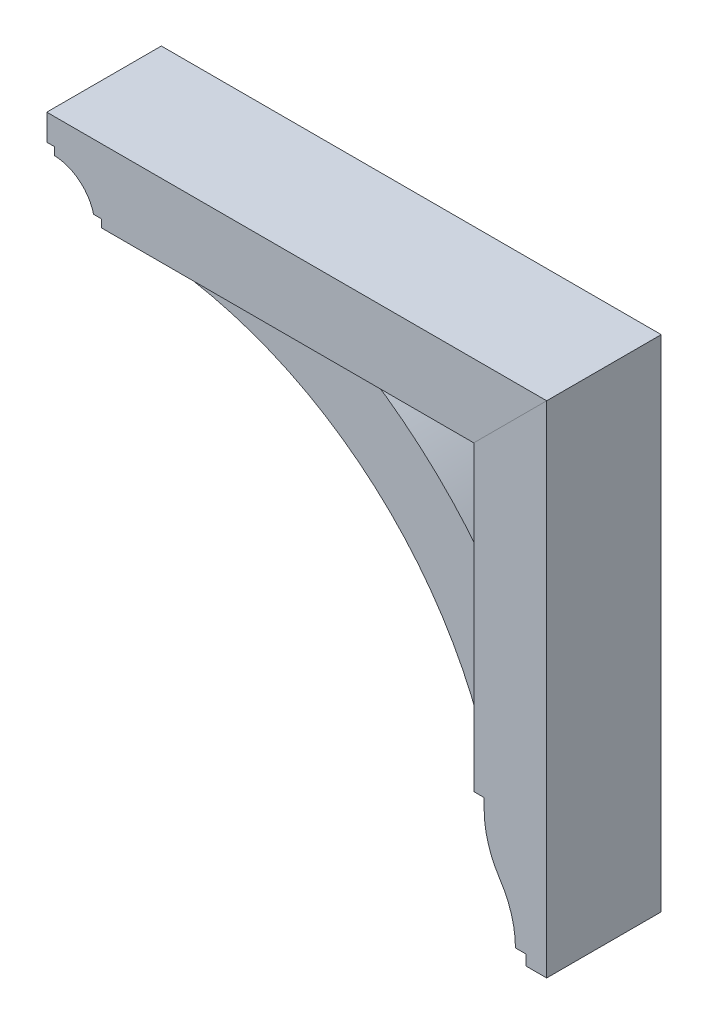
ISO-10303-21;
HEADER;
FILE_DESCRIPTION(('STEP AP214'),'2;1');
FILE_NAME('part.step','',(''),(''),'','','');
FILE_SCHEMA(('AUTOMOTIVE_DESIGN { 1 0 10303 214 1 1 1 1 }'));
ENDSEC;
DATA;
#1=APPLICATION_CONTEXT('core data for automotive mechanical design processes');
#2=APPLICATION_PROTOCOL_DEFINITION('international standard','automotive_design',2000,#1);
#3=PRODUCT_CONTEXT('',#1,'mechanical');
#4=PRODUCT('Part','Part','',(#3));
#5=PRODUCT_RELATED_PRODUCT_CATEGORY('part','',(#4));
#6=PRODUCT_DEFINITION_FORMATION('','',#4);
#7=PRODUCT_DEFINITION_CONTEXT('part definition',#1,'design');
#8=PRODUCT_DEFINITION('design','',#6,#7);
#9=PRODUCT_DEFINITION_SHAPE('','',#8);
#10=(LENGTH_UNIT() NAMED_UNIT(*) SI_UNIT(.MILLI.,.METRE.));
#11=(NAMED_UNIT(*) PLANE_ANGLE_UNIT() SI_UNIT($,.RADIAN.));
#12=(NAMED_UNIT(*) SI_UNIT($,.STERADIAN.) SOLID_ANGLE_UNIT());
#13=UNCERTAINTY_MEASURE_WITH_UNIT(LENGTH_MEASURE(1.E-05),#10,'distance_accuracy_value','');
#14=(GEOMETRIC_REPRESENTATION_CONTEXT(3) GLOBAL_UNCERTAINTY_ASSIGNED_CONTEXT((#13)) GLOBAL_UNIT_ASSIGNED_CONTEXT((#10,
#11,#12)) REPRESENTATION_CONTEXT('',''));
#15=CARTESIAN_POINT('',(0.,0.,0.));
#16=DIRECTION('',(0.,0.,1.));
#17=DIRECTION('',(1.,0.,0.));
#18=AXIS2_PLACEMENT_3D('',#15,#16,#17);
#19=CARTESIAN_POINT('',(246.881223015558,-2.15821431605898E-12,69.85));
#20=DIRECTION('',(1.,0.,0.));
#21=DIRECTION('',(0.,1.,0.));
#22=AXIS2_PLACEMENT_3D('',#19,#20,#21);
#23=PLANE('',#22);
#24=DIRECTION('',(0.,-1.,0.));
#25=VECTOR('',#24,1.);
#26=CARTESIAN_POINT('',(246.881223015558,-2.15821431605898E-12,-69.85));
#27=LINE('',#26,#25);
#28=CARTESIAN_POINT('',(246.881223015556,-183.515,-69.85));
#29=VERTEX_POINT('',#28);
#30=CARTESIAN_POINT('',(246.881223015556,-196.215,-69.85));
#31=VERTEX_POINT('',#30);
#32=EDGE_CURVE('E176',#29,#31,#27,.T.);
#33=ORIENTED_EDGE('',*,*,#32,.T.);
#34=DIRECTION('',(0.,0.,-1.));
#35=VECTOR('',#34,1.);
#36=CARTESIAN_POINT('',(246.881223015556,-196.215,69.85));
#37=LINE('',#36,#35);
#38=CARTESIAN_POINT('',(246.881223015556,-196.215,69.85));
#39=VERTEX_POINT('',#38);
#40=EDGE_CURVE('E12',#39,#31,#37,.T.);
#41=ORIENTED_EDGE('',*,*,#40,.F.);
#42=DIRECTION('',(0.,-1.,0.));
#43=VECTOR('',#42,1.);
#44=CARTESIAN_POINT('',(246.881223015558,-2.15821431605898E-12,69.85));
#45=LINE('',#44,#43);
#46=CARTESIAN_POINT('',(246.881223015556,-183.515,69.85));
#47=VERTEX_POINT('',#46);
#48=EDGE_CURVE('E209',#47,#39,#45,.T.);
#49=ORIENTED_EDGE('',*,*,#48,.F.);
#50=DIRECTION('',(0.,0.,-1.));
#51=VECTOR('',#50,1.);
#52=CARTESIAN_POINT('',(246.881223015556,-183.515,69.85));
#53=LINE('',#52,#51);
#54=EDGE_CURVE('E172',#47,#29,#53,.T.);
#55=ORIENTED_EDGE('',*,*,#54,.T.);
#56=EDGE_LOOP('',(#33,#41,#49,#55));
#57=FACE_BOUND('',#56,.T.);
#58=ADVANCED_FACE('F60',(#57),#23,.F.);
#59=CARTESIAN_POINT('',(362.768723015556,-196.215,69.85));
#60=DIRECTION('',(0.,0.,-1.));
#61=DIRECTION('',(-1.,0.,0.));
#62=AXIS2_PLACEMENT_3D('',#59,#60,#61);
#63=CYLINDRICAL_SURFACE('',#62,115.8875);
#64=CARTESIAN_POINT('',(362.768723015556,-196.215,-69.85));
#65=DIRECTION('',(0.,0.,1.));
#66=DIRECTION('',(1.,0.,0.));
#67=AXIS2_PLACEMENT_3D('',#64,#65,#66);
#68=CIRCLE('',#67,115.8875);
#69=CARTESIAN_POINT('',(266.018608336656,-260.006284403669,-69.85));
#70=VERTEX_POINT('',#69);
#71=EDGE_CURVE('E180',#31,#70,#68,.T.);
#72=ORIENTED_EDGE('',*,*,#71,.T.);
#73=DIRECTION('',(0.,0.,-1.));
#74=VECTOR('',#73,1.);
#75=CARTESIAN_POINT('',(266.018608336656,-260.006284403669,69.85));
#76=LINE('',#75,#74);
#77=CARTESIAN_POINT('',(266.018608336656,-260.006284403669,69.85));
#78=VERTEX_POINT('',#77);
#79=EDGE_CURVE('E69',#78,#70,#76,.T.);
#80=ORIENTED_EDGE('',*,*,#79,.F.);
#81=CARTESIAN_POINT('',(362.768723015556,-196.215,69.85));
#82=DIRECTION('',(0.,0.,1.));
#83=DIRECTION('',(1.,0.,0.));
#84=AXIS2_PLACEMENT_3D('',#81,#82,#83);
#85=CIRCLE('',#84,115.8875);
#86=EDGE_CURVE('E126',#39,#78,#85,.T.);
#87=ORIENTED_EDGE('',*,*,#86,.F.);
#88=ORIENTED_EDGE('',*,*,#40,.T.);
#89=EDGE_LOOP('',(#72,#80,#87,#88));
#90=FACE_BOUND('',#89,.T.);
#91=ADVANCED_FACE('F233',(#90),#63,.T.);
#92=CARTESIAN_POINT('',(170.152056348885,-323.215,69.85));
#93=DIRECTION('',(0.,0.,-1.));
#94=DIRECTION('',(-1.,0.,0.));
#95=AXIS2_PLACEMENT_3D('',#92,#93,#94);
#96=CYLINDRICAL_SURFACE('',#95,114.82916666667);
#97=CARTESIAN_POINT('',(170.152056348885,-323.215,-69.85));
#98=DIRECTION('',(0.,0.,1.));
#99=DIRECTION('',(1.,0.,0.));
#100=AXIS2_PLACEMENT_3D('',#97,#98,#99);
#101=CIRCLE('',#100,114.82916666667);
#102=CARTESIAN_POINT('',(284.981223015555,-323.215,-69.85));
#103=VERTEX_POINT('',#102);
#104=EDGE_CURVE('E184',#103,#70,#101,.T.);
#105=ORIENTED_EDGE('',*,*,#104,.F.);
#106=DIRECTION('',(0.,0.,-1.));
#107=VECTOR('',#106,1.);
#108=CARTESIAN_POINT('',(284.981223015555,-323.215,69.85));
#109=LINE('',#108,#107);
#110=CARTESIAN_POINT('',(284.981223015555,-323.215,69.85));
#111=VERTEX_POINT('',#110);
#112=EDGE_CURVE('E223',#111,#103,#109,.T.);
#113=ORIENTED_EDGE('',*,*,#112,.F.);
#114=CARTESIAN_POINT('',(170.152056348885,-323.215,69.85));
#115=DIRECTION('',(0.,0.,1.));
#116=DIRECTION('',(1.,0.,0.));
#117=AXIS2_PLACEMENT_3D('',#114,#115,#116);
#118=CIRCLE('',#117,114.82916666667);
#119=EDGE_CURVE('E232',#111,#78,#118,.T.);
#120=ORIENTED_EDGE('',*,*,#119,.T.);
#121=ORIENTED_EDGE('',*,*,#79,.T.);
#122=EDGE_LOOP('',(#105,#113,#120,#121));
#123=FACE_BOUND('',#122,.T.);
#124=ADVANCED_FACE('F230',(#123),#96,.F.);
#125=CARTESIAN_POINT('',(0.,-323.215,69.85));
#126=DIRECTION('',(0.,-1.,0.));
#127=DIRECTION('',(0.,0.,-1.));
#128=AXIS2_PLACEMENT_3D('',#125,#126,#127);
#129=PLANE('',#128);
#130=DIRECTION('',(-1.,0.,0.));
#131=VECTOR('',#130,1.);
#132=CARTESIAN_POINT('',(0.,-323.215,-69.85));
#133=LINE('',#132,#131);
#134=CARTESIAN_POINT('',(297.681223015555,-323.215,-69.85));
#135=VERTEX_POINT('',#134);
#136=EDGE_CURVE('E188',#135,#103,#133,.T.);
#137=ORIENTED_EDGE('',*,*,#136,.F.);
#138=DIRECTION('',(0.,0.,-1.));
#139=VECTOR('',#138,1.);
#140=CARTESIAN_POINT('',(297.681223015555,-323.215,69.85));
#141=LINE('',#140,#139);
#142=CARTESIAN_POINT('',(297.681223015555,-323.215,69.85));
#143=VERTEX_POINT('',#142);
#144=EDGE_CURVE('E220',#143,#135,#141,.T.);
#145=ORIENTED_EDGE('',*,*,#144,.F.);
#146=DIRECTION('',(-1.,0.,0.));
#147=VECTOR('',#146,1.);
#148=CARTESIAN_POINT('',(0.,-323.215,69.85));
#149=LINE('',#148,#147);
#150=EDGE_CURVE('E244',#143,#111,#149,.T.);
#151=ORIENTED_EDGE('',*,*,#150,.T.);
#152=ORIENTED_EDGE('',*,*,#112,.T.);
#153=EDGE_LOOP('',(#137,#145,#151,#152));
#154=FACE_BOUND('',#153,.T.);
#155=ADVANCED_FACE('F241',(#154),#129,.T.);
#156=CARTESIAN_POINT('',(297.681223015555,0.,69.85));
#157=DIRECTION('',(-1.,0.,0.));
#158=DIRECTION('',(0.,0.,1.));
#159=AXIS2_PLACEMENT_3D('',#156,#157,#158);
#160=PLANE('',#159);
#161=DIRECTION('',(0.,1.,0.));
#162=VECTOR('',#161,1.);
#163=CARTESIAN_POINT('',(297.681223015555,0.,-69.85));
#164=LINE('',#163,#162);
#165=CARTESIAN_POINT('',(297.681223015555,-335.915,-69.85));
#166=VERTEX_POINT('',#165);
#167=EDGE_CURVE('E192',#166,#135,#164,.T.);
#168=ORIENTED_EDGE('',*,*,#167,.F.);
#169=DIRECTION('',(0.,0.,-1.));
#170=VECTOR('',#169,1.);
#171=CARTESIAN_POINT('',(297.681223015555,-335.915,69.85));
#172=LINE('',#171,#170);
#173=CARTESIAN_POINT('',(297.681223015555,-335.915,69.85));
#174=VERTEX_POINT('',#173);
#175=EDGE_CURVE('E218',#174,#166,#172,.T.);
#176=ORIENTED_EDGE('',*,*,#175,.F.);
#177=DIRECTION('',(0.,1.,0.));
#178=VECTOR('',#177,1.);
#179=CARTESIAN_POINT('',(297.681223015555,0.,69.85));
#180=LINE('',#179,#178);
#181=EDGE_CURVE('E250',#174,#143,#180,.T.);
#182=ORIENTED_EDGE('',*,*,#181,.T.);
#183=ORIENTED_EDGE('',*,*,#144,.T.);
#184=EDGE_LOOP('',(#168,#176,#182,#183));
#185=FACE_BOUND('',#184,.T.);
#186=ADVANCED_FACE('F265',(#185),#160,.T.);
#187=CARTESIAN_POINT('',(7.34134975033387E-13,-335.915000000001,69.85));
#188=DIRECTION('',(0.,-1.,0.));
#189=DIRECTION('',(1.,0.,0.));
#190=AXIS2_PLACEMENT_3D('',#187,#188,#189);
#191=PLANE('',#190);
#192=DIRECTION('',(-1.,0.,0.));
#193=VECTOR('',#192,1.);
#194=CARTESIAN_POINT('',(7.34134975033387E-13,-335.915000000001,-69.85));
#195=LINE('',#194,#193);
#196=CARTESIAN_POINT('',(323.081223015555,-335.915,-69.85));
#197=VERTEX_POINT('',#196);
#198=EDGE_CURVE('E196',#197,#166,#195,.T.);
#199=ORIENTED_EDGE('',*,*,#198,.F.);
#200=DIRECTION('',(0.,0.,-1.));
#201=VECTOR('',#200,1.);
#202=CARTESIAN_POINT('',(323.081223015555,-335.915,69.85));
#203=LINE('',#202,#201);
#204=CARTESIAN_POINT('',(323.081223015555,-335.915,69.85));
#205=VERTEX_POINT('',#204);
#206=EDGE_CURVE('E215',#205,#197,#203,.T.);
#207=ORIENTED_EDGE('',*,*,#206,.F.);
#208=DIRECTION('',(-1.,0.,0.));
#209=VECTOR('',#208,1.);
#210=CARTESIAN_POINT('',(7.34134975033387E-13,-335.915000000001,69.85));
#211=LINE('',#210,#209);
#212=EDGE_CURVE('E257',#205,#174,#211,.T.);
#213=ORIENTED_EDGE('',*,*,#212,.T.);
#214=ORIENTED_EDGE('',*,*,#175,.T.);
#215=EDGE_LOOP('',(#199,#207,#213,#214));
#216=FACE_BOUND('',#215,.T.);
#217=ADVANCED_FACE('F263',(#216),#191,.T.);
#218=CARTESIAN_POINT('',(323.081223015555,0.,69.85));
#219=DIRECTION('',(-1.,0.,0.));
#220=DIRECTION('',(0.,0.,1.));
#221=AXIS2_PLACEMENT_3D('',#218,#219,#220);
#222=PLANE('',#221);
#223=DIRECTION('',(0.,1.,0.));
#224=VECTOR('',#223,1.);
#225=CARTESIAN_POINT('',(323.081223015555,0.,-69.85));
#226=LINE('',#225,#224);
#227=CARTESIAN_POINT('',(323.081223015555,273.685,-69.85));
#228=VERTEX_POINT('',#227);
#229=EDGE_CURVE('E200',#197,#228,#226,.T.);
#230=ORIENTED_EDGE('',*,*,#229,.T.);
#231=DIRECTION('',(0.,0.,-1.));
#232=VECTOR('',#231,1.);
#233=CARTESIAN_POINT('',(323.081223015555,273.685,69.85));
#234=LINE('',#233,#232);
#235=CARTESIAN_POINT('',(323.081223015555,273.685,69.85));
#236=VERTEX_POINT('',#235);
#237=EDGE_CURVE('E163',#236,#228,#234,.T.);
#238=ORIENTED_EDGE('',*,*,#237,.F.);
#239=DIRECTION('',(0.,1.,0.));
#240=VECTOR('',#239,1.);
#241=CARTESIAN_POINT('',(323.081223015555,0.,69.85));
#242=LINE('',#241,#240);
#243=EDGE_CURVE('E152',#205,#236,#242,.T.);
#244=ORIENTED_EDGE('',*,*,#243,.F.);
#245=ORIENTED_EDGE('',*,*,#206,.T.);
#246=EDGE_LOOP('',(#230,#238,#244,#245));
#247=FACE_BOUND('',#246,.T.);
#248=ADVANCED_FACE('F268',(#247),#222,.F.);
#249=CARTESIAN_POINT('',(24.6981115077795,-24.6981115077792,69.85));
#250=DIRECTION('',(0.707106781186552,-0.707106781186543,0.));
#251=DIRECTION('',(0.707106781186543,0.707106781186552,0.));
#252=AXIS2_PLACEMENT_3D('',#249,#250,#251);
#253=PLANE('',#252);
#254=DIRECTION('',(-0.707106781186543,-0.707106781186552,0.));
#255=VECTOR('',#254,1.);
#256=CARTESIAN_POINT('',(24.6981115077795,-24.6981115077792,-69.85));
#257=LINE('',#256,#255);
#258=CARTESIAN_POINT('',(234.181223015556,184.785,-69.85));
#259=VERTEX_POINT('',#258);
#260=EDGE_CURVE('E161',#228,#259,#257,.T.);
#261=ORIENTED_EDGE('',*,*,#260,.T.);
#262=DIRECTION('',(0.,0.,-1.));
#263=VECTOR('',#262,1.);
#264=CARTESIAN_POINT('',(234.181223015556,184.785,69.85));
#265=LINE('',#264,#263);
#266=CARTESIAN_POINT('',(234.181223015556,184.785,69.85));
#267=VERTEX_POINT('',#266);
#268=EDGE_CURVE('E158',#267,#259,#265,.T.);
#269=ORIENTED_EDGE('',*,*,#268,.F.);
#270=DIRECTION('',(-0.707106781186543,-0.707106781186552,0.));
#271=VECTOR('',#270,1.);
#272=CARTESIAN_POINT('',(24.6981115077795,-24.6981115077792,69.85));
#273=LINE('',#272,#271);
#274=EDGE_CURVE('E145',#236,#267,#273,.T.);
#275=ORIENTED_EDGE('',*,*,#274,.F.);
#276=ORIENTED_EDGE('',*,*,#237,.T.);
#277=EDGE_LOOP('',(#261,#269,#275,#276));
#278=FACE_BOUND('',#277,.T.);
#279=ADVANCED_FACE('F159',(#278),#253,.F.);
#280=CARTESIAN_POINT('',(234.181223015556,0.,69.85));
#281=DIRECTION('',(1.,0.,0.));
#282=DIRECTION('',(0.,1.,0.));
#283=AXIS2_PLACEMENT_3D('',#280,#281,#282);
#284=PLANE('',#283);
#285=DIRECTION('',(0.,-1.,0.));
#286=VECTOR('',#285,1.);
#287=CARTESIAN_POINT('',(234.181223015556,0.,-69.85));
#288=LINE('',#287,#286);
#289=CARTESIAN_POINT('',(234.181223015556,-183.515,-69.85));
#290=VERTEX_POINT('',#289);
#291=EDGE_CURVE('E112',#259,#290,#288,.T.);
#292=ORIENTED_EDGE('',*,*,#291,.T.);
#293=DIRECTION('',(0.,0.,-1.));
#294=VECTOR('',#293,1.);
#295=CARTESIAN_POINT('',(234.181223015556,-183.515,69.85));
#296=LINE('',#295,#294);
#297=CARTESIAN_POINT('',(234.181223015556,-183.515,69.85));
#298=VERTEX_POINT('',#297);
#299=EDGE_CURVE('E164',#298,#290,#296,.T.);
#300=ORIENTED_EDGE('',*,*,#299,.F.);
#301=DIRECTION('',(0.,-1.,0.));
#302=VECTOR('',#301,1.);
#303=CARTESIAN_POINT('',(234.181223015556,0.,69.85));
#304=LINE('',#303,#302);
#305=EDGE_CURVE('E149',#267,#298,#304,.T.);
#306=ORIENTED_EDGE('',*,*,#305,.F.);
#307=ORIENTED_EDGE('',*,*,#268,.T.);
#308=EDGE_LOOP('',(#292,#300,#306,#307));
#309=FACE_BOUND('',#308,.T.);
#310=ADVANCED_FACE('F166',(#309),#284,.F.);
#311=CARTESIAN_POINT('',(0.,-183.515,69.85));
#312=DIRECTION('',(0.,1.,0.));
#313=DIRECTION('',(0.,0.,1.));
#314=AXIS2_PLACEMENT_3D('',#311,#312,#313);
#315=PLANE('',#314);
#316=DIRECTION('',(1.,0.,0.));
#317=VECTOR('',#316,1.);
#318=CARTESIAN_POINT('',(0.,-183.515,-69.85));
#319=LINE('',#318,#317);
#320=EDGE_CURVE('E118',#290,#29,#319,.T.);
#321=ORIENTED_EDGE('',*,*,#320,.T.);
#322=ORIENTED_EDGE('',*,*,#54,.F.);
#323=DIRECTION('',(1.,0.,0.));
#324=VECTOR('',#323,1.);
#325=CARTESIAN_POINT('',(0.,-183.515,69.85));
#326=LINE('',#325,#324);
#327=EDGE_CURVE('E77',#298,#47,#326,.T.);
#328=ORIENTED_EDGE('',*,*,#327,.F.);
#329=ORIENTED_EDGE('',*,*,#299,.T.);
#330=EDGE_LOOP('',(#321,#322,#328,#329));
#331=FACE_BOUND('',#330,.T.);
#332=ADVANCED_FACE('F283',(#331),#315,.F.);
#333=CARTESIAN_POINT('',(0.,0.,69.85));
#334=DIRECTION('',(0.,0.,1.));
#335=DIRECTION('',(1.,0.,0.));
#336=AXIS2_PLACEMENT_3D('',#333,#334,#335);
#337=PLANE('',#336);
#338=ORIENTED_EDGE('',*,*,#48,.T.);
#339=ORIENTED_EDGE('',*,*,#86,.T.);
#340=ORIENTED_EDGE('',*,*,#119,.F.);
#341=ORIENTED_EDGE('',*,*,#150,.F.);
#342=ORIENTED_EDGE('',*,*,#181,.F.);
#343=ORIENTED_EDGE('',*,*,#212,.F.);
#344=ORIENTED_EDGE('',*,*,#243,.T.);
#345=ORIENTED_EDGE('',*,*,#274,.T.);
#346=ORIENTED_EDGE('',*,*,#305,.T.);
#347=ORIENTED_EDGE('',*,*,#327,.T.);
#348=EDGE_LOOP('',(#338,#339,#340,#341,#342,#343,#344,#345,#346,#347));
#349=FACE_BOUND('',#348,.T.);
#350=ADVANCED_FACE('F147',(#349),#337,.T.);
#351=CARTESIAN_POINT('',(0.,0.,-69.85));
#352=DIRECTION('',(0.,0.,1.));
#353=DIRECTION('',(1.,0.,0.));
#354=AXIS2_PLACEMENT_3D('',#351,#352,#353);
#355=PLANE('',#354);
#356=ORIENTED_EDGE('',*,*,#32,.F.);
#357=ORIENTED_EDGE('',*,*,#320,.F.);
#358=ORIENTED_EDGE('',*,*,#291,.F.);
#359=ORIENTED_EDGE('',*,*,#260,.F.);
#360=ORIENTED_EDGE('',*,*,#229,.F.);
#361=ORIENTED_EDGE('',*,*,#198,.T.);
#362=ORIENTED_EDGE('',*,*,#167,.T.);
#363=ORIENTED_EDGE('',*,*,#136,.T.);
#364=ORIENTED_EDGE('',*,*,#104,.T.);
#365=ORIENTED_EDGE('',*,*,#71,.F.);
#366=EDGE_LOOP('',(#356,#357,#358,#359,#360,#361,#362,#363,#364,#365));
#367=FACE_BOUND('',#366,.T.);
#368=ADVANCED_FACE('F237',(#367),#355,.F.);
#369=CLOSED_SHELL('',(#58,#91,#124,#155,#186,#217,#248,#279,#310,#332,#350,#368));
#370=MANIFOLD_SOLID_BREP('B2',#369);
#371=CARTESIAN_POINT('',(200.023896988908,10.1443010911424,44.45));
#372=DIRECTION('',(0.,0.,-1.));
#373=DIRECTION('',(-1.,0.,0.));
#374=AXIS2_PLACEMENT_3D('',#371,#372,#373);
#375=CYLINDRICAL_SURFACE('',#374,35.9243612642702);
#376=CARTESIAN_POINT('',(200.023896988908,10.1443010911424,-44.45));
#377=DIRECTION('',(0.,0.,1.));
#378=DIRECTION('',(1.,0.,0.));
#379=AXIS2_PLACEMENT_3D('',#376,#377,#378);
#380=CIRCLE('',#379,35.9243612642702);
#381=CARTESIAN_POINT('',(234.076180435781,21.5898995595342,-44.45));
#382=VERTEX_POINT('',#381);
#383=CARTESIAN_POINT('',(234.181223015556,21.2724999999998,-44.45));
#384=VERTEX_POINT('',#383);
#385=EDGE_CURVE('E499',#382,#384,#380,.F.);
#386=ORIENTED_EDGE('',*,*,#385,.F.);
#387=DIRECTION('',(0.,0.,-1.));
#388=VECTOR('',#387,1.);
#389=CARTESIAN_POINT('',(234.076180435781,21.5898995595342,44.45));
#390=LINE('',#389,#388);
#391=CARTESIAN_POINT('',(234.076180435781,21.5898995595342,44.45));
#392=VERTEX_POINT('',#391);
#393=EDGE_CURVE('E58',#392,#382,#390,.T.);
#394=ORIENTED_EDGE('',*,*,#393,.F.);
#395=CARTESIAN_POINT('',(200.023896988908,10.1443010911424,44.45));
#396=DIRECTION('',(0.,0.,1.));
#397=DIRECTION('',(1.,0.,0.));
#398=AXIS2_PLACEMENT_3D('',#395,#396,#397);
#399=CIRCLE('',#398,35.9243612642702);
#400=CARTESIAN_POINT('',(234.181223015556,21.2724999999998,44.45));
#401=VERTEX_POINT('',#400);
#402=EDGE_CURVE('E521',#392,#401,#399,.F.);
#403=ORIENTED_EDGE('',*,*,#402,.T.);
#404=DIRECTION('',(0.,0.,-1.));
#405=VECTOR('',#404,1.);
#406=CARTESIAN_POINT('',(234.181223015556,21.2724999999998,44.45));
#407=LINE('',#406,#405);
#408=EDGE_CURVE('E420',#401,#384,#407,.T.);
#409=ORIENTED_EDGE('',*,*,#408,.T.);
#410=EDGE_LOOP('',(#386,#394,#403,#409));
#411=FACE_BOUND('',#410,.T.);
#412=ADVANCED_FACE('F403',(#411),#375,.T.);
#413=CARTESIAN_POINT('',(-213.963923235164,-290.541472633944,44.45));
#414=DIRECTION('',(0.,0.,-1.));
#415=DIRECTION('',(-1.,0.,0.));
#416=AXIS2_PLACEMENT_3D('',#413,#414,#415);
#417=CYLINDRICAL_SURFACE('',#416,546.045719701982);
#418=CARTESIAN_POINT('',(-213.963923235164,-290.541472633944,-44.45));
#419=DIRECTION('',(0.,0.,1.));
#420=DIRECTION('',(1.,0.,0.));
#421=AXIS2_PLACEMENT_3D('',#418,#419,#420);
#422=CIRCLE('',#421,546.045719701982);
#423=CARTESIAN_POINT('',(54.793723015556,184.785,-44.45));
#424=VERTEX_POINT('',#423);
#425=EDGE_CURVE('E502',#382,#424,#422,.T.);
#426=ORIENTED_EDGE('',*,*,#425,.T.);
#427=DIRECTION('',(0.,0.,-1.));
#428=VECTOR('',#427,1.);
#429=CARTESIAN_POINT('',(54.793723015556,184.785,44.45));
#430=LINE('',#429,#428);
#431=CARTESIAN_POINT('',(54.793723015556,184.785,44.45));
#432=VERTEX_POINT('',#431);
#433=EDGE_CURVE('E412',#432,#424,#430,.T.);
#434=ORIENTED_EDGE('',*,*,#433,.F.);
#435=CARTESIAN_POINT('',(-213.963923235164,-290.541472633944,44.45));
#436=DIRECTION('',(0.,0.,1.));
#437=DIRECTION('',(1.,0.,0.));
#438=AXIS2_PLACEMENT_3D('',#435,#436,#437);
#439=CIRCLE('',#438,546.045719701982);
#440=EDGE_CURVE('E547',#392,#432,#439,.T.);
#441=ORIENTED_EDGE('',*,*,#440,.F.);
#442=ORIENTED_EDGE('',*,*,#393,.T.);
#443=EDGE_LOOP('',(#426,#434,#441,#442));
#444=FACE_BOUND('',#443,.T.);
#445=ADVANCED_FACE('F540',(#444),#417,.T.);
#446=CARTESIAN_POINT('',(0.,184.785,44.45));
#447=DIRECTION('',(0.,1.,0.));
#448=DIRECTION('',(0.,0.,1.));
#449=AXIS2_PLACEMENT_3D('',#446,#447,#448);
#450=PLANE('',#449);
#451=DIRECTION('',(1.,0.,0.));
#452=VECTOR('',#451,1.);
#453=CARTESIAN_POINT('',(0.,184.785,-44.45));
#454=LINE('',#453,#452);
#455=CARTESIAN_POINT('',(-184.918776984445,184.785,-44.45));
#456=VERTEX_POINT('',#455);
#457=EDGE_CURVE('E505',#456,#424,#454,.T.);
#458=ORIENTED_EDGE('',*,*,#457,.F.);
#459=DIRECTION('',(0.,0.,-1.));
#460=VECTOR('',#459,1.);
#461=CARTESIAN_POINT('',(-184.918776984445,184.785,44.45));
#462=LINE('',#461,#460);
#463=CARTESIAN_POINT('',(-184.918776984445,184.785,44.45));
#464=VERTEX_POINT('',#463);
#465=EDGE_CURVE('E528',#464,#456,#462,.T.);
#466=ORIENTED_EDGE('',*,*,#465,.F.);
#467=DIRECTION('',(1.,0.,0.));
#468=VECTOR('',#467,1.);
#469=CARTESIAN_POINT('',(0.,184.785,44.45));
#470=LINE('',#469,#468);
#471=EDGE_CURVE('E537',#464,#432,#470,.T.);
#472=ORIENTED_EDGE('',*,*,#471,.T.);
#473=ORIENTED_EDGE('',*,*,#433,.T.);
#474=EDGE_LOOP('',(#458,#466,#472,#473));
#475=FACE_BOUND('',#474,.T.);
#476=ADVANCED_FACE('F536',(#475),#450,.T.);
#477=CARTESIAN_POINT('',(-184.918776984445,0.,44.45));
#478=DIRECTION('',(1.,0.,0.));
#479=DIRECTION('',(0.,0.,-1.));
#480=AXIS2_PLACEMENT_3D('',#477,#478,#479);
#481=PLANE('',#480);
#482=DIRECTION('',(0.,-1.,0.));
#483=VECTOR('',#482,1.);
#484=CARTESIAN_POINT('',(-184.918776984445,0.,-44.45));
#485=LINE('',#484,#483);
#486=CARTESIAN_POINT('',(-184.918776984445,165.735,-44.45));
#487=VERTEX_POINT('',#486);
#488=EDGE_CURVE('E509',#456,#487,#485,.T.);
#489=ORIENTED_EDGE('',*,*,#488,.T.);
#490=DIRECTION('',(0.,0.,-1.));
#491=VECTOR('',#490,1.);
#492=CARTESIAN_POINT('',(-184.918776984445,165.735,44.45));
#493=LINE('',#492,#491);
#494=CARTESIAN_POINT('',(-184.918776984445,165.735,44.45));
#495=VERTEX_POINT('',#494);
#496=EDGE_CURVE('E487',#495,#487,#493,.T.);
#497=ORIENTED_EDGE('',*,*,#496,.F.);
#498=DIRECTION('',(0.,-1.,0.));
#499=VECTOR('',#498,1.);
#500=CARTESIAN_POINT('',(-184.918776984445,0.,44.45));
#501=LINE('',#500,#499);
#502=EDGE_CURVE('E473',#464,#495,#501,.T.);
#503=ORIENTED_EDGE('',*,*,#502,.F.);
#504=ORIENTED_EDGE('',*,*,#465,.T.);
#505=EDGE_LOOP('',(#489,#497,#503,#504));
#506=FACE_BOUND('',#505,.T.);
#507=ADVANCED_FACE('F545',(#506),#481,.F.);
#508=CARTESIAN_POINT('',(-213.963923235164,-290.541472633944,44.45));
#509=DIRECTION('',(0.,0.,-1.));
#510=DIRECTION('',(-1.,0.,0.));
#511=AXIS2_PLACEMENT_3D('',#508,#509,#510);
#512=CYLINDRICAL_SURFACE('',#511,457.2);
#513=CARTESIAN_POINT('',(-213.963923235164,-290.541472633944,-44.45));
#514=DIRECTION('',(0.,0.,1.));
#515=DIRECTION('',(1.,0.,0.));
#516=AXIS2_PLACEMENT_3D('',#513,#514,#515);
#517=CIRCLE('',#516,457.2);
#518=CARTESIAN_POINT('',(215.131223015556,-132.715,-44.45));
#519=VERTEX_POINT('',#518);
#520=EDGE_CURVE('E483',#487,#519,#517,.F.);
#521=ORIENTED_EDGE('',*,*,#520,.T.);
#522=DIRECTION('',(0.,0.,-1.));
#523=VECTOR('',#522,1.);
#524=CARTESIAN_POINT('',(215.131223015556,-132.715,44.45));
#525=LINE('',#524,#523);
#526=CARTESIAN_POINT('',(215.131223015556,-132.715,44.45));
#527=VERTEX_POINT('',#526);
#528=EDGE_CURVE('E480',#527,#519,#525,.T.);
#529=ORIENTED_EDGE('',*,*,#528,.F.);
#530=CARTESIAN_POINT('',(-213.963923235164,-290.541472633944,44.45));
#531=DIRECTION('',(0.,0.,1.));
#532=DIRECTION('',(1.,0.,0.));
#533=AXIS2_PLACEMENT_3D('',#530,#531,#532);
#534=CIRCLE('',#533,457.2);
#535=EDGE_CURVE('E464',#495,#527,#534,.F.);
#536=ORIENTED_EDGE('',*,*,#535,.F.);
#537=ORIENTED_EDGE('',*,*,#496,.T.);
#538=EDGE_LOOP('',(#521,#529,#536,#537));
#539=FACE_BOUND('',#538,.T.);
#540=ADVANCED_FACE('F481',(#539),#512,.F.);
#541=CARTESIAN_POINT('',(0.,-132.715,44.45));
#542=DIRECTION('',(0.,-1.,0.));
#543=DIRECTION('',(0.,0.,-1.));
#544=AXIS2_PLACEMENT_3D('',#541,#542,#543);
#545=PLANE('',#544);
#546=DIRECTION('',(-1.,0.,0.));
#547=VECTOR('',#546,1.);
#548=CARTESIAN_POINT('',(0.,-132.715,-44.45));
#549=LINE('',#548,#547);
#550=CARTESIAN_POINT('',(234.181223015556,-132.715,-44.45));
#551=VERTEX_POINT('',#550);
#552=EDGE_CURVE('E514',#551,#519,#549,.T.);
#553=ORIENTED_EDGE('',*,*,#552,.F.);
#554=DIRECTION('',(0.,0.,-1.));
#555=VECTOR('',#554,1.);
#556=CARTESIAN_POINT('',(234.181223015556,-132.715,44.45));
#557=LINE('',#556,#555);
#558=CARTESIAN_POINT('',(234.181223015556,-132.715,44.45));
#559=VERTEX_POINT('',#558);
#560=EDGE_CURVE('E442',#559,#551,#557,.T.);
#561=ORIENTED_EDGE('',*,*,#560,.F.);
#562=DIRECTION('',(-1.,0.,0.));
#563=VECTOR('',#562,1.);
#564=CARTESIAN_POINT('',(0.,-132.715,44.45));
#565=LINE('',#564,#563);
#566=EDGE_CURVE('E470',#559,#527,#565,.T.);
#567=ORIENTED_EDGE('',*,*,#566,.T.);
#568=ORIENTED_EDGE('',*,*,#528,.T.);
#569=EDGE_LOOP('',(#553,#561,#567,#568));
#570=FACE_BOUND('',#569,.T.);
#571=ADVANCED_FACE('F489',(#570),#545,.T.);
#572=CARTESIAN_POINT('',(234.181223015556,0.,44.45));
#573=DIRECTION('',(1.,0.,0.));
#574=DIRECTION('',(0.,1.,0.));
#575=AXIS2_PLACEMENT_3D('',#572,#573,#574);
#576=PLANE('',#575);
#577=DIRECTION('',(0.,-1.,0.));
#578=VECTOR('',#577,1.);
#579=CARTESIAN_POINT('',(234.181223015556,0.,-44.45));
#580=LINE('',#579,#578);
#581=EDGE_CURVE('E517',#384,#551,#580,.T.);
#582=ORIENTED_EDGE('',*,*,#581,.F.);
#583=ORIENTED_EDGE('',*,*,#408,.F.);
#584=DIRECTION('',(0.,-1.,0.));
#585=VECTOR('',#584,1.);
#586=CARTESIAN_POINT('',(234.181223015556,0.,44.45));
#587=LINE('',#586,#585);
#588=EDGE_CURVE('E491',#401,#559,#587,.T.);
#589=ORIENTED_EDGE('',*,*,#588,.T.);
#590=ORIENTED_EDGE('',*,*,#560,.T.);
#591=EDGE_LOOP('',(#582,#583,#589,#590));
#592=FACE_BOUND('',#591,.T.);
#593=ADVANCED_FACE('F552',(#592),#576,.T.);
#594=CARTESIAN_POINT('',(0.,0.,44.45));
#595=DIRECTION('',(0.,0.,1.));
#596=DIRECTION('',(1.,0.,0.));
#597=AXIS2_PLACEMENT_3D('',#594,#595,#596);
#598=PLANE('',#597);
#599=ORIENTED_EDGE('',*,*,#402,.F.);
#600=ORIENTED_EDGE('',*,*,#440,.T.);
#601=ORIENTED_EDGE('',*,*,#471,.F.);
#602=ORIENTED_EDGE('',*,*,#502,.T.);
#603=ORIENTED_EDGE('',*,*,#535,.T.);
#604=ORIENTED_EDGE('',*,*,#566,.F.);
#605=ORIENTED_EDGE('',*,*,#588,.F.);
#606=EDGE_LOOP('',(#599,#600,#601,#602,#603,#604,#605));
#607=FACE_BOUND('',#606,.T.);
#608=ADVANCED_FACE('F467',(#607),#598,.T.);
#609=CARTESIAN_POINT('',(0.,0.,-44.45));
#610=DIRECTION('',(0.,0.,1.));
#611=DIRECTION('',(1.,0.,0.));
#612=AXIS2_PLACEMENT_3D('',#609,#610,#611);
#613=PLANE('',#612);
#614=ORIENTED_EDGE('',*,*,#385,.T.);
#615=ORIENTED_EDGE('',*,*,#581,.T.);
#616=ORIENTED_EDGE('',*,*,#552,.T.);
#617=ORIENTED_EDGE('',*,*,#520,.F.);
#618=ORIENTED_EDGE('',*,*,#488,.F.);
#619=ORIENTED_EDGE('',*,*,#457,.T.);
#620=ORIENTED_EDGE('',*,*,#425,.F.);
#621=EDGE_LOOP('',(#614,#615,#616,#617,#618,#619,#620));
#622=FACE_BOUND('',#621,.T.);
#623=ADVANCED_FACE('F543',(#622),#613,.F.);
#624=CLOSED_SHELL('',(#412,#445,#476,#507,#540,#571,#593,#608,#623));
#625=MANIFOLD_SOLID_BREP('B6',#624);
#626=CARTESIAN_POINT('',(-276.993776984445,0.,69.85));
#627=DIRECTION('',(-1.,0.,0.));
#628=DIRECTION('',(0.,0.,1.));
#629=AXIS2_PLACEMENT_3D('',#626,#627,#628);
#630=PLANE('',#629);
#631=DIRECTION('',(0.,1.,0.));
#632=VECTOR('',#631,1.);
#633=CARTESIAN_POINT('',(-276.993776984445,0.,-69.85));
#634=LINE('',#633,#632);
#635=CARTESIAN_POINT('',(-276.993776984445,232.41,-69.85));
#636=VERTEX_POINT('',#635);
#637=CARTESIAN_POINT('',(-276.993776984445,241.935,-69.85));
#638=VERTEX_POINT('',#637);
#639=EDGE_CURVE('E751',#636,#638,#634,.T.);
#640=ORIENTED_EDGE('',*,*,#639,.F.);
#641=DIRECTION('',(0.,0.,-1.));
#642=VECTOR('',#641,1.);
#643=CARTESIAN_POINT('',(-276.993776984445,232.41,69.85));
#644=LINE('',#643,#642);
#645=CARTESIAN_POINT('',(-276.993776984445,232.41,69.85));
#646=VERTEX_POINT('',#645);
#647=EDGE_CURVE('E401',#646,#636,#644,.T.);
#648=ORIENTED_EDGE('',*,*,#647,.F.);
#649=DIRECTION('',(0.,1.,0.));
#650=VECTOR('',#649,1.);
#651=CARTESIAN_POINT('',(-276.993776984445,0.,69.85));
#652=LINE('',#651,#650);
#653=CARTESIAN_POINT('',(-276.993776984445,241.935,69.85));
#654=VERTEX_POINT('',#653);
#655=EDGE_CURVE('E781',#646,#654,#652,.T.);
#656=ORIENTED_EDGE('',*,*,#655,.T.);
#657=DIRECTION('',(0.,0.,-1.));
#658=VECTOR('',#657,1.);
#659=CARTESIAN_POINT('',(-276.993776984445,241.935,69.85));
#660=LINE('',#659,#658);
#661=EDGE_CURVE('E661',#654,#638,#660,.T.);
#662=ORIENTED_EDGE('',*,*,#661,.T.);
#663=EDGE_LOOP('',(#640,#648,#656,#662));
#664=FACE_BOUND('',#663,.T.);
#665=ADVANCED_FACE('F644',(#664),#630,.T.);
#666=CARTESIAN_POINT('',(-278.509879625893,181.69924669819,69.85));
#667=DIRECTION('',(0.,0.,-1.));
#668=DIRECTION('',(-1.,0.,0.));
#669=AXIS2_PLACEMENT_3D('',#666,#667,#668);
#670=CYLINDRICAL_SURFACE('',#669,50.7334117486338);
#671=CARTESIAN_POINT('',(-278.509879625893,181.69924669819,-69.85));
#672=DIRECTION('',(0.,0.,1.));
#673=DIRECTION('',(1.,0.,0.));
#674=AXIS2_PLACEMENT_3D('',#671,#672,#673);
#675=CIRCLE('',#674,50.7334117486338);
#676=CARTESIAN_POINT('',(-229.368776984445,194.31,-69.85));
#677=VERTEX_POINT('',#676);
#678=EDGE_CURVE('E753',#636,#677,#675,.F.);
#679=ORIENTED_EDGE('',*,*,#678,.T.);
#680=DIRECTION('',(0.,0.,-1.));
#681=VECTOR('',#680,1.);
#682=CARTESIAN_POINT('',(-229.368776984445,194.31,69.85));
#683=LINE('',#682,#681);
#684=CARTESIAN_POINT('',(-229.368776984445,194.31,69.85));
#685=VERTEX_POINT('',#684);
#686=EDGE_CURVE('E653',#685,#677,#683,.T.);
#687=ORIENTED_EDGE('',*,*,#686,.F.);
#688=CARTESIAN_POINT('',(-278.509879625893,181.69924669819,69.85));
#689=DIRECTION('',(0.,0.,1.));
#690=DIRECTION('',(1.,0.,0.));
#691=AXIS2_PLACEMENT_3D('',#688,#689,#690);
#692=CIRCLE('',#691,50.7334117486338);
#693=EDGE_CURVE('E820',#646,#685,#692,.F.);
#694=ORIENTED_EDGE('',*,*,#693,.F.);
#695=ORIENTED_EDGE('',*,*,#647,.T.);
#696=EDGE_LOOP('',(#679,#687,#694,#695));
#697=FACE_BOUND('',#696,.T.);
#698=ADVANCED_FACE('F809',(#697),#670,.F.);
#699=CARTESIAN_POINT('',(0.,194.31,69.85));
#700=DIRECTION('',(0.,-1.,0.));
#701=DIRECTION('',(0.,0.,-1.));
#702=AXIS2_PLACEMENT_3D('',#699,#700,#701);
#703=PLANE('',#702);
#704=DIRECTION('',(-1.,0.,0.));
#705=VECTOR('',#704,1.);
#706=CARTESIAN_POINT('',(0.,194.31,-69.85));
#707=LINE('',#706,#705);
#708=CARTESIAN_POINT('',(-219.843776984445,194.31,-69.85));
#709=VERTEX_POINT('',#708);
#710=EDGE_CURVE('E756',#709,#677,#707,.T.);
#711=ORIENTED_EDGE('',*,*,#710,.F.);
#712=DIRECTION('',(0.,0.,-1.));
#713=VECTOR('',#712,1.);
#714=CARTESIAN_POINT('',(-219.843776984445,194.31,69.85));
#715=LINE('',#714,#713);
#716=CARTESIAN_POINT('',(-219.843776984445,194.31,69.85));
#717=VERTEX_POINT('',#716);
#718=EDGE_CURVE('E794',#717,#709,#715,.T.);
#719=ORIENTED_EDGE('',*,*,#718,.F.);
#720=DIRECTION('',(-1.,0.,0.));
#721=VECTOR('',#720,1.);
#722=CARTESIAN_POINT('',(0.,194.31,69.85));
#723=LINE('',#722,#721);
#724=EDGE_CURVE('E806',#717,#685,#723,.T.);
#725=ORIENTED_EDGE('',*,*,#724,.T.);
#726=ORIENTED_EDGE('',*,*,#686,.T.);
#727=EDGE_LOOP('',(#711,#719,#725,#726));
#728=FACE_BOUND('',#727,.T.);
#729=ADVANCED_FACE('F804',(#728),#703,.T.);
#730=CARTESIAN_POINT('',(-219.843776984445,0.,69.85));
#731=DIRECTION('',(-1.,0.,0.));
#732=DIRECTION('',(0.,0.,1.));
#733=AXIS2_PLACEMENT_3D('',#730,#731,#732);
#734=PLANE('',#733);
#735=DIRECTION('',(0.,1.,0.));
#736=VECTOR('',#735,1.);
#737=CARTESIAN_POINT('',(-219.843776984445,0.,-69.85));
#738=LINE('',#737,#736);
#739=CARTESIAN_POINT('',(-219.843776984445,184.785,-69.85));
#740=VERTEX_POINT('',#739);
#741=EDGE_CURVE('E760',#740,#709,#738,.T.);
#742=ORIENTED_EDGE('',*,*,#741,.F.);
#743=DIRECTION('',(0.,0.,-1.));
#744=VECTOR('',#743,1.);
#745=CARTESIAN_POINT('',(-219.843776984445,184.785,69.85));
#746=LINE('',#745,#744);
#747=CARTESIAN_POINT('',(-219.843776984445,184.785,69.85));
#748=VERTEX_POINT('',#747);
#749=EDGE_CURVE('E791',#748,#740,#746,.T.);
#750=ORIENTED_EDGE('',*,*,#749,.F.);
#751=DIRECTION('',(0.,1.,0.));
#752=VECTOR('',#751,1.);
#753=CARTESIAN_POINT('',(-219.843776984445,0.,69.85));
#754=LINE('',#753,#752);
#755=EDGE_CURVE('E819',#748,#717,#754,.T.);
#756=ORIENTED_EDGE('',*,*,#755,.T.);
#757=ORIENTED_EDGE('',*,*,#718,.T.);
#758=EDGE_LOOP('',(#742,#750,#756,#757));
#759=FACE_BOUND('',#758,.T.);
#760=ADVANCED_FACE('F815',(#759),#734,.T.);
#761=CARTESIAN_POINT('',(0.,184.785,69.85));
#762=DIRECTION('',(0.,1.,0.));
#763=DIRECTION('',(0.,0.,1.));
#764=AXIS2_PLACEMENT_3D('',#761,#762,#763);
#765=PLANE('',#764);
#766=DIRECTION('',(1.,0.,0.));
#767=VECTOR('',#766,1.);
#768=CARTESIAN_POINT('',(0.,184.785,-69.85));
#769=LINE('',#768,#767);
#770=CARTESIAN_POINT('',(234.181223015556,184.785,-69.85));
#771=VERTEX_POINT('',#770);
#772=EDGE_CURVE('E764',#740,#771,#769,.T.);
#773=ORIENTED_EDGE('',*,*,#772,.T.);
#774=DIRECTION('',(0.,0.,-1.));
#775=VECTOR('',#774,1.);
#776=CARTESIAN_POINT('',(234.181223015556,184.785,69.85));
#777=LINE('',#776,#775);
#778=CARTESIAN_POINT('',(234.181223015556,184.785,69.85));
#779=VERTEX_POINT('',#778);
#780=EDGE_CURVE('E788',#779,#771,#777,.T.);
#781=ORIENTED_EDGE('',*,*,#780,.F.);
#782=DIRECTION('',(1.,0.,0.));
#783=VECTOR('',#782,1.);
#784=CARTESIAN_POINT('',(0.,184.785,69.85));
#785=LINE('',#784,#783);
#786=EDGE_CURVE('E824',#748,#779,#785,.T.);
#787=ORIENTED_EDGE('',*,*,#786,.F.);
#788=ORIENTED_EDGE('',*,*,#749,.T.);
#789=EDGE_LOOP('',(#773,#781,#787,#788));
#790=FACE_BOUND('',#789,.T.);
#791=ADVANCED_FACE('F858',(#790),#765,.F.);
#792=CARTESIAN_POINT('',(24.6981115077795,-24.6981115077792,69.85));
#793=DIRECTION('',(0.707106781186552,-0.707106781186543,0.));
#794=DIRECTION('',(0.707106781186543,0.707106781186552,0.));
#795=AXIS2_PLACEMENT_3D('',#792,#793,#794);
#796=PLANE('',#795);
#797=DIRECTION('',(-0.707106781186543,-0.707106781186552,0.));
#798=VECTOR('',#797,1.);
#799=CARTESIAN_POINT('',(24.6981115077795,-24.6981115077792,-69.85));
#800=LINE('',#799,#798);
#801=CARTESIAN_POINT('',(323.081223015555,273.685,-69.85));
#802=VERTEX_POINT('',#801);
#803=EDGE_CURVE('E768',#802,#771,#800,.T.);
#804=ORIENTED_EDGE('',*,*,#803,.F.);
#805=DIRECTION('',(0.,0.,-1.));
#806=VECTOR('',#805,1.);
#807=CARTESIAN_POINT('',(323.081223015555,273.685,69.85));
#808=LINE('',#807,#806);
#809=CARTESIAN_POINT('',(323.081223015555,273.685,69.85));
#810=VERTEX_POINT('',#809);
#811=EDGE_CURVE('E738',#810,#802,#808,.T.);
#812=ORIENTED_EDGE('',*,*,#811,.F.);
#813=DIRECTION('',(-0.707106781186543,-0.707106781186552,0.));
#814=VECTOR('',#813,1.);
#815=CARTESIAN_POINT('',(24.6981115077795,-24.6981115077792,69.85));
#816=LINE('',#815,#814);
#817=EDGE_CURVE('E726',#810,#779,#816,.T.);
#818=ORIENTED_EDGE('',*,*,#817,.T.);
#819=ORIENTED_EDGE('',*,*,#780,.T.);
#820=EDGE_LOOP('',(#804,#812,#818,#819));
#821=FACE_BOUND('',#820,.T.);
#822=ADVANCED_FACE('F835',(#821),#796,.T.);
#823=CARTESIAN_POINT('',(0.,273.685,69.85));
#824=DIRECTION('',(0.,-1.,0.));
#825=DIRECTION('',(0.,0.,-1.));
#826=AXIS2_PLACEMENT_3D('',#823,#824,#825);
#827=PLANE('',#826);
#828=DIRECTION('',(-1.,0.,0.));
#829=VECTOR('',#828,1.);
#830=CARTESIAN_POINT('',(0.,273.685,-69.85));
#831=LINE('',#830,#829);
#832=CARTESIAN_POINT('',(-286.518776984445,273.685,-69.85));
#833=VERTEX_POINT('',#832);
#834=EDGE_CURVE('E734',#802,#833,#831,.T.);
#835=ORIENTED_EDGE('',*,*,#834,.T.);
#836=DIRECTION('',(0.,0.,-1.));
#837=VECTOR('',#836,1.);
#838=CARTESIAN_POINT('',(-286.518776984445,273.685,69.85));
#839=LINE('',#838,#837);
#840=CARTESIAN_POINT('',(-286.518776984445,273.685,69.85));
#841=VERTEX_POINT('',#840);
#842=EDGE_CURVE('E731',#841,#833,#839,.T.);
#843=ORIENTED_EDGE('',*,*,#842,.F.);
#844=DIRECTION('',(-1.,0.,0.));
#845=VECTOR('',#844,1.);
#846=CARTESIAN_POINT('',(0.,273.685,69.85));
#847=LINE('',#846,#845);
#848=EDGE_CURVE('E718',#810,#841,#847,.T.);
#849=ORIENTED_EDGE('',*,*,#848,.F.);
#850=ORIENTED_EDGE('',*,*,#811,.T.);
#851=EDGE_LOOP('',(#835,#843,#849,#850));
#852=FACE_BOUND('',#851,.T.);
#853=ADVANCED_FACE('F732',(#852),#827,.F.);
#854=CARTESIAN_POINT('',(-286.518776984445,0.,69.85));
#855=DIRECTION('',(1.,0.,0.));
#856=DIRECTION('',(0.,0.,-1.));
#857=AXIS2_PLACEMENT_3D('',#854,#855,#856);
#858=PLANE('',#857);
#859=DIRECTION('',(0.,-1.,0.));
#860=VECTOR('',#859,1.);
#861=CARTESIAN_POINT('',(-286.518776984445,0.,-69.85));
#862=LINE('',#861,#860);
#863=CARTESIAN_POINT('',(-286.518776984445,241.935,-69.85));
#864=VERTEX_POINT('',#863);
#865=EDGE_CURVE('E774',#833,#864,#862,.T.);
#866=ORIENTED_EDGE('',*,*,#865,.T.);
#867=DIRECTION('',(0.,0.,-1.));
#868=VECTOR('',#867,1.);
#869=CARTESIAN_POINT('',(-286.518776984445,241.935,69.85));
#870=LINE('',#869,#868);
#871=CARTESIAN_POINT('',(-286.518776984445,241.935,69.85));
#872=VERTEX_POINT('',#871);
#873=EDGE_CURVE('E690',#872,#864,#870,.T.);
#874=ORIENTED_EDGE('',*,*,#873,.F.);
#875=DIRECTION('',(0.,-1.,0.));
#876=VECTOR('',#875,1.);
#877=CARTESIAN_POINT('',(-286.518776984445,0.,69.85));
#878=LINE('',#877,#876);
#879=EDGE_CURVE('E724',#841,#872,#878,.T.);
#880=ORIENTED_EDGE('',*,*,#879,.F.);
#881=ORIENTED_EDGE('',*,*,#842,.T.);
#882=EDGE_LOOP('',(#866,#874,#880,#881));
#883=FACE_BOUND('',#882,.T.);
#884=ADVANCED_FACE('F740',(#883),#858,.F.);
#885=CARTESIAN_POINT('',(-7.04991620636976E-13,241.935000000001,69.85));
#886=DIRECTION('',(0.,-1.,0.));
#887=DIRECTION('',(1.,0.,0.));
#888=AXIS2_PLACEMENT_3D('',#885,#886,#887);
#889=PLANE('',#888);
#890=DIRECTION('',(-1.,0.,0.));
#891=VECTOR('',#890,1.);
#892=CARTESIAN_POINT('',(-7.04991620636976E-13,241.935000000001,-69.85));
#893=LINE('',#892,#891);
#894=EDGE_CURVE('E777',#638,#864,#893,.T.);
#895=ORIENTED_EDGE('',*,*,#894,.F.);
#896=ORIENTED_EDGE('',*,*,#661,.F.);
#897=DIRECTION('',(-1.,0.,0.));
#898=VECTOR('',#897,1.);
#899=CARTESIAN_POINT('',(-7.04991620636976E-13,241.935000000001,69.85));
#900=LINE('',#899,#898);
#901=EDGE_CURVE('E742',#654,#872,#900,.T.);
#902=ORIENTED_EDGE('',*,*,#901,.T.);
#903=ORIENTED_EDGE('',*,*,#873,.T.);
#904=EDGE_LOOP('',(#895,#896,#902,#903));
#905=FACE_BOUND('',#904,.T.);
#906=ADVANCED_FACE('F837',(#905),#889,.T.);
#907=CARTESIAN_POINT('',(0.,0.,69.85));
#908=DIRECTION('',(0.,0.,1.));
#909=DIRECTION('',(1.,0.,0.));
#910=AXIS2_PLACEMENT_3D('',#907,#908,#909);
#911=PLANE('',#910);
#912=ORIENTED_EDGE('',*,*,#655,.F.);
#913=ORIENTED_EDGE('',*,*,#693,.T.);
#914=ORIENTED_EDGE('',*,*,#724,.F.);
#915=ORIENTED_EDGE('',*,*,#755,.F.);
#916=ORIENTED_EDGE('',*,*,#786,.T.);
#917=ORIENTED_EDGE('',*,*,#817,.F.);
#918=ORIENTED_EDGE('',*,*,#848,.T.);
#919=ORIENTED_EDGE('',*,*,#879,.T.);
#920=ORIENTED_EDGE('',*,*,#901,.F.);
#921=EDGE_LOOP('',(#912,#913,#914,#915,#916,#917,#918,#919,#920));
#922=FACE_BOUND('',#921,.T.);
#923=ADVANCED_FACE('F721',(#922),#911,.T.);
#924=CARTESIAN_POINT('',(0.,0.,-69.85));
#925=DIRECTION('',(0.,0.,1.));
#926=DIRECTION('',(1.,0.,0.));
#927=AXIS2_PLACEMENT_3D('',#924,#925,#926);
#928=PLANE('',#927);
#929=ORIENTED_EDGE('',*,*,#639,.T.);
#930=ORIENTED_EDGE('',*,*,#894,.T.);
#931=ORIENTED_EDGE('',*,*,#865,.F.);
#932=ORIENTED_EDGE('',*,*,#834,.F.);
#933=ORIENTED_EDGE('',*,*,#803,.T.);
#934=ORIENTED_EDGE('',*,*,#772,.F.);
#935=ORIENTED_EDGE('',*,*,#741,.T.);
#936=ORIENTED_EDGE('',*,*,#710,.T.);
#937=ORIENTED_EDGE('',*,*,#678,.F.);
#938=EDGE_LOOP('',(#929,#930,#931,#932,#933,#934,#935,#936,#937));
#939=FACE_BOUND('',#938,.T.);
#940=ADVANCED_FACE('F811',(#939),#928,.F.);
#941=CLOSED_SHELL('',(#665,#698,#729,#760,#791,#822,#853,#884,#906,#923,#940));
#942=MANIFOLD_SOLID_BREP('B52',#941);
#943=ADVANCED_BREP_SHAPE_REPRESENTATION('',(#18,#370,#625,#942),#14);
#944=SHAPE_DEFINITION_REPRESENTATION(#9,#943);
ENDSEC;
END-ISO-10303-21;
